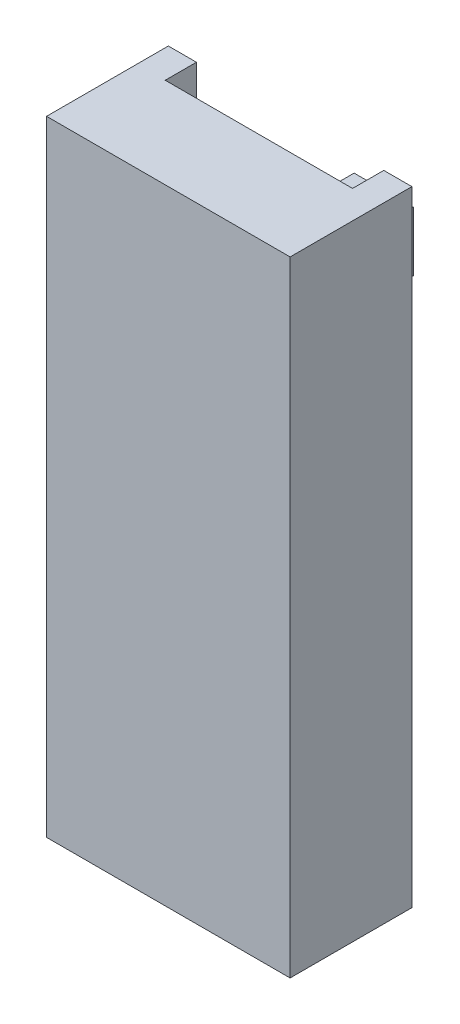
ISO-10303-21;
HEADER;
FILE_DESCRIPTION(('STEP AP214'),'2;1');
FILE_NAME('part.step','',(''),(''),'','','');
FILE_SCHEMA(('AUTOMOTIVE_DESIGN { 1 0 10303 214 1 1 1 1 }'));
ENDSEC;
DATA;
#1=APPLICATION_CONTEXT('core data for automotive mechanical design processes');
#2=APPLICATION_PROTOCOL_DEFINITION('international standard','automotive_design',2000,#1);
#3=PRODUCT_CONTEXT('',#1,'mechanical');
#4=PRODUCT('Part','Part','',(#3));
#5=PRODUCT_RELATED_PRODUCT_CATEGORY('part','',(#4));
#6=PRODUCT_DEFINITION_FORMATION('','',#4);
#7=PRODUCT_DEFINITION_CONTEXT('part definition',#1,'design');
#8=PRODUCT_DEFINITION('design','',#6,#7);
#9=PRODUCT_DEFINITION_SHAPE('','',#8);
#10=(LENGTH_UNIT() NAMED_UNIT(*) SI_UNIT(.MILLI.,.METRE.));
#11=(NAMED_UNIT(*) PLANE_ANGLE_UNIT() SI_UNIT($,.RADIAN.));
#12=(NAMED_UNIT(*) SI_UNIT($,.STERADIAN.) SOLID_ANGLE_UNIT());
#13=UNCERTAINTY_MEASURE_WITH_UNIT(LENGTH_MEASURE(1.E-05),#10,'distance_accuracy_value','');
#14=(GEOMETRIC_REPRESENTATION_CONTEXT(3) GLOBAL_UNCERTAINTY_ASSIGNED_CONTEXT((#13)) GLOBAL_UNIT_ASSIGNED_CONTEXT((#10,
#11,#12)) REPRESENTATION_CONTEXT('',''));
#15=CARTESIAN_POINT('',(0.,0.,0.));
#16=DIRECTION('',(0.,0.,1.));
#17=DIRECTION('',(1.,0.,0.));
#18=AXIS2_PLACEMENT_3D('',#15,#16,#17);
#19=CARTESIAN_POINT('',(-2.63874073652364,20.,-2.19751319098254));
#20=DIRECTION('',(0.,0.,1.));
#21=DIRECTION('',(1.,0.,0.));
#22=AXIS2_PLACEMENT_3D('',#19,#20,#21);
#23=PLANE('',#22);
#24=DIRECTION('',(-1.,0.,0.));
#25=VECTOR('',#24,1.);
#26=CARTESIAN_POINT('',(1.26125926347636,15.5,-2.19751319098254));
#27=LINE('',#26,#25);
#28=CARTESIAN_POINT('',(1.26125926347636,15.5,-2.19751319098254));
#29=VERTEX_POINT('',#28);
#30=CARTESIAN_POINT('',(-0.738740736523644,15.5,-2.19751319098254));
#31=VERTEX_POINT('',#30);
#32=EDGE_CURVE('E211',#29,#31,#27,.T.);
#33=ORIENTED_EDGE('',*,*,#32,.F.);
#34=DIRECTION('',(0.,-1.,0.));
#35=VECTOR('',#34,1.);
#36=CARTESIAN_POINT('',(1.26125926347636,17.5,-2.19751319098254));
#37=LINE('',#36,#35);
#38=CARTESIAN_POINT('',(1.26125926347636,17.5,-2.19751319098254));
#39=VERTEX_POINT('',#38);
#40=EDGE_CURVE('E48',#39,#29,#37,.T.);
#41=ORIENTED_EDGE('',*,*,#40,.F.);
#42=DIRECTION('',(1.,0.,0.));
#43=VECTOR('',#42,1.);
#44=CARTESIAN_POINT('',(1.26125926347636,17.5,-2.19751319098254));
#45=LINE('',#44,#43);
#46=CARTESIAN_POINT('',(-0.738740736523643,17.5,-2.19751319098254));
#47=VERTEX_POINT('',#46);
#48=EDGE_CURVE('E202',#47,#39,#45,.T.);
#49=ORIENTED_EDGE('',*,*,#48,.F.);
#50=DIRECTION('',(0.,1.,0.));
#51=VECTOR('',#50,1.);
#52=CARTESIAN_POINT('',(-0.738740736523643,17.5,-2.19751319098254));
#53=LINE('',#52,#51);
#54=EDGE_CURVE('E205',#31,#47,#53,.T.);
#55=ORIENTED_EDGE('',*,*,#54,.F.);
#56=EDGE_LOOP('',(#33,#41,#49,#55));
#57=FACE_BOUND('',#56,.T.);
#58=DIRECTION('',(-1.,0.,0.));
#59=VECTOR('',#58,1.);
#60=CARTESIAN_POINT('',(4.26125926347636,18.,-2.19751319098254));
#61=LINE('',#60,#59);
#62=CARTESIAN_POINT('',(4.26125926347636,18.,-2.19751319098254));
#63=VERTEX_POINT('',#62);
#64=CARTESIAN_POINT('',(-1.73874073652364,18.,-2.19751319098254));
#65=VERTEX_POINT('',#64);
#66=EDGE_CURVE('E254',#63,#65,#61,.T.);
#67=ORIENTED_EDGE('',*,*,#66,.F.);
#68=DIRECTION('',(0.,1.,0.));
#69=VECTOR('',#68,1.);
#70=CARTESIAN_POINT('',(4.26125926347636,18.,-2.19751319098254));
#71=LINE('',#70,#69);
#72=CARTESIAN_POINT('',(4.26125926347636,20.,-2.19751319098254));
#73=VERTEX_POINT('',#72);
#74=EDGE_CURVE('E264',#63,#73,#71,.T.);
#75=ORIENTED_EDGE('',*,*,#74,.T.);
#76=DIRECTION('',(-1.,0.,0.));
#77=VECTOR('',#76,1.);
#78=CARTESIAN_POINT('',(-2.63874073652364,20.,-2.19751319098254));
#79=LINE('',#78,#77);
#80=CARTESIAN_POINT('',(5.16125926347636,20.,-2.19751319098254));
#81=VERTEX_POINT('',#80);
#82=EDGE_CURVE('E333',#81,#73,#79,.T.);
#83=ORIENTED_EDGE('',*,*,#82,.F.);
#84=DIRECTION('',(0.,-1.,0.));
#85=VECTOR('',#84,1.);
#86=CARTESIAN_POINT('',(5.16125926347636,20.,-2.19751319098254));
#87=LINE('',#86,#85);
#88=CARTESIAN_POINT('',(5.16125926347636,0.,-2.19751319098254));
#89=VERTEX_POINT('',#88);
#90=EDGE_CURVE('E348',#81,#89,#87,.T.);
#91=ORIENTED_EDGE('',*,*,#90,.T.);
#92=DIRECTION('',(-1.,0.,0.));
#93=VECTOR('',#92,1.);
#94=CARTESIAN_POINT('',(-2.63874073652364,0.,-2.19751319098254));
#95=LINE('',#94,#93);
#96=CARTESIAN_POINT('',(4.26125926347636,0.,-2.19751319098254));
#97=VERTEX_POINT('',#96);
#98=EDGE_CURVE('E328',#89,#97,#95,.T.);
#99=ORIENTED_EDGE('',*,*,#98,.T.);
#100=DIRECTION('',(0.,-1.,0.));
#101=VECTOR('',#100,1.);
#102=CARTESIAN_POINT('',(4.26125926347636,15.,-2.19751319098254));
#103=LINE('',#102,#101);
#104=CARTESIAN_POINT('',(4.26125926347636,15.,-2.19751319098254));
#105=VERTEX_POINT('',#104);
#106=EDGE_CURVE('E315',#105,#97,#103,.T.);
#107=ORIENTED_EDGE('',*,*,#106,.F.);
#108=DIRECTION('',(1.,0.,0.));
#109=VECTOR('',#108,1.);
#110=CARTESIAN_POINT('',(0.,15.,-2.19751319098254));
#111=LINE('',#110,#109);
#112=CARTESIAN_POINT('',(-1.73874073652364,15.,-2.19751319098254));
#113=VERTEX_POINT('',#112);
#114=EDGE_CURVE('E288',#113,#105,#111,.T.);
#115=ORIENTED_EDGE('',*,*,#114,.F.);
#116=DIRECTION('',(0.,-1.,0.));
#117=VECTOR('',#116,1.);
#118=CARTESIAN_POINT('',(-1.73874073652364,15.,-2.19751319098254));
#119=LINE('',#118,#117);
#120=CARTESIAN_POINT('',(-1.73874073652364,0.,-2.19751319098254));
#121=VERTEX_POINT('',#120);
#122=EDGE_CURVE('E317',#113,#121,#119,.T.);
#123=ORIENTED_EDGE('',*,*,#122,.T.);
#124=CARTESIAN_POINT('',(-2.63874073652364,0.,-2.19751319098254));
#125=VERTEX_POINT('',#124);
#126=EDGE_CURVE('E343',#121,#125,#95,.T.);
#127=ORIENTED_EDGE('',*,*,#126,.T.);
#128=DIRECTION('',(0.,-1.,0.));
#129=VECTOR('',#128,1.);
#130=CARTESIAN_POINT('',(-2.63874073652364,20.,-2.19751319098254));
#131=LINE('',#130,#129);
#132=CARTESIAN_POINT('',(-2.63874073652364,20.,-2.19751319098254));
#133=VERTEX_POINT('',#132);
#134=EDGE_CURVE('E336',#133,#125,#131,.T.);
#135=ORIENTED_EDGE('',*,*,#134,.F.);
#136=CARTESIAN_POINT('',(-1.73874073652364,20.,-2.19751319098254));
#137=VERTEX_POINT('',#136);
#138=EDGE_CURVE('E332',#137,#133,#79,.T.);
#139=ORIENTED_EDGE('',*,*,#138,.F.);
#140=DIRECTION('',(0.,1.,0.));
#141=VECTOR('',#140,1.);
#142=CARTESIAN_POINT('',(-1.73874073652364,18.,-2.19751319098254));
#143=LINE('',#142,#141);
#144=EDGE_CURVE('E276',#65,#137,#143,.T.);
#145=ORIENTED_EDGE('',*,*,#144,.F.);
#146=EDGE_LOOP('',(#67,#75,#83,#91,#99,#107,#115,#123,#127,#135,#139,#145));
#147=FACE_BOUND('',#146,.T.);
#148=DIRECTION('',(0.,-1.,0.));
#149=VECTOR('',#148,1.);
#150=CARTESIAN_POINT('',(3.21125926347636,17.45,-2.19751319098254));
#151=LINE('',#150,#149);
#152=CARTESIAN_POINT('',(3.21125926347636,17.45,-2.19751319098254));
#153=VERTEX_POINT('',#152);
#154=CARTESIAN_POINT('',(3.21125926347636,15.55,-2.19751319098254));
#155=VERTEX_POINT('',#154);
#156=EDGE_CURVE('E217',#153,#155,#151,.T.);
#157=ORIENTED_EDGE('',*,*,#156,.F.);
#158=DIRECTION('',(1.,0.,0.));
#159=VECTOR('',#158,1.);
#160=CARTESIAN_POINT('',(3.21125926347636,17.45,-2.19751319098254));
#161=LINE('',#160,#159);
#162=CARTESIAN_POINT('',(1.31125926347636,17.45,-2.19751319098254));
#163=VERTEX_POINT('',#162);
#164=EDGE_CURVE('E225',#163,#153,#161,.T.);
#165=ORIENTED_EDGE('',*,*,#164,.F.);
#166=DIRECTION('',(0.,1.,0.));
#167=VECTOR('',#166,1.);
#168=CARTESIAN_POINT('',(1.31125926347636,17.45,-2.19751319098254));
#169=LINE('',#168,#167);
#170=CARTESIAN_POINT('',(1.31125926347636,15.55,-2.19751319098254));
#171=VERTEX_POINT('',#170);
#172=EDGE_CURVE('E235',#171,#163,#169,.T.);
#173=ORIENTED_EDGE('',*,*,#172,.F.);
#174=DIRECTION('',(-1.,0.,0.));
#175=VECTOR('',#174,1.);
#176=CARTESIAN_POINT('',(3.21125926347636,15.55,-2.19751319098254));
#177=LINE('',#176,#175);
#178=EDGE_CURVE('E56',#155,#171,#177,.T.);
#179=ORIENTED_EDGE('',*,*,#178,.F.);
#180=EDGE_LOOP('',(#157,#165,#173,#179));
#181=FACE_BOUND('',#180,.T.);
#182=ADVANCED_FACE('F33',(#57,#147,#181),#23,.F.);
#183=CARTESIAN_POINT('',(0.,0.,0.));
#184=DIRECTION('',(0.,1.,0.));
#185=DIRECTION('',(0.,0.,1.));
#186=AXIS2_PLACEMENT_3D('',#183,#184,#185);
#187=PLANE('',#186);
#188=DIRECTION('',(0.,0.,-1.));
#189=VECTOR('',#188,1.);
#190=CARTESIAN_POINT('',(4.26125926347635,0.,0.));
#191=LINE('',#190,#189);
#192=CARTESIAN_POINT('',(4.26125926347636,0.,-1.44751319098254));
#193=VERTEX_POINT('',#192);
#194=EDGE_CURVE('E304',#193,#97,#191,.T.);
#195=ORIENTED_EDGE('',*,*,#194,.T.);
#196=ORIENTED_EDGE('',*,*,#98,.F.);
#197=DIRECTION('',(0.,0.,-1.));
#198=VECTOR('',#197,1.);
#199=CARTESIAN_POINT('',(5.16125926347636,0.,-2.19751319098254));
#200=LINE('',#199,#198);
#201=CARTESIAN_POINT('',(5.16125926347636,0.,1.70248680901746));
#202=VERTEX_POINT('',#201);
#203=EDGE_CURVE('E341',#202,#89,#200,.T.);
#204=ORIENTED_EDGE('',*,*,#203,.F.);
#205=DIRECTION('',(1.,0.,0.));
#206=VECTOR('',#205,1.);
#207=CARTESIAN_POINT('',(-2.63874073652364,0.,1.70248680901746));
#208=LINE('',#207,#206);
#209=CARTESIAN_POINT('',(-2.63874073652364,0.,1.70248680901746));
#210=VERTEX_POINT('',#209);
#211=EDGE_CURVE('E339',#210,#202,#208,.T.);
#212=ORIENTED_EDGE('',*,*,#211,.F.);
#213=DIRECTION('',(0.,0.,1.));
#214=VECTOR('',#213,1.);
#215=CARTESIAN_POINT('',(-2.63874073652364,0.,-2.19751319098254));
#216=LINE('',#215,#214);
#217=EDGE_CURVE('E312',#125,#210,#216,.T.);
#218=ORIENTED_EDGE('',*,*,#217,.F.);
#219=ORIENTED_EDGE('',*,*,#126,.F.);
#220=DIRECTION('',(0.,0.,1.));
#221=VECTOR('',#220,1.);
#222=CARTESIAN_POINT('',(-1.73874073652364,0.,0.));
#223=LINE('',#222,#221);
#224=CARTESIAN_POINT('',(-1.73874073652364,0.,-1.44751319098254));
#225=VERTEX_POINT('',#224);
#226=EDGE_CURVE('E301',#121,#225,#223,.T.);
#227=ORIENTED_EDGE('',*,*,#226,.T.);
#228=DIRECTION('',(1.,0.,0.));
#229=VECTOR('',#228,1.);
#230=CARTESIAN_POINT('',(0.,0.,-1.44751319098254));
#231=LINE('',#230,#229);
#232=CARTESIAN_POINT('',(-0.0377788422003011,0.,-1.44751319098254));
#233=VERTEX_POINT('',#232);
#234=EDGE_CURVE('E298',#225,#233,#231,.T.);
#235=ORIENTED_EDGE('',*,*,#234,.T.);
#236=CARTESIAN_POINT('',(1.26125926347636,0.,-2.19751319098254));
#237=DIRECTION('',(0.,-1.,0.));
#238=DIRECTION('',(0.,0.,-1.));
#239=AXIS2_PLACEMENT_3D('',#236,#237,#238);
#240=CIRCLE('',#239,1.5);
#241=CARTESIAN_POINT('',(2.56029736915302,0.,-1.44751319098254));
#242=VERTEX_POINT('',#241);
#243=EDGE_CURVE('E273',#233,#242,#240,.F.);
#244=ORIENTED_EDGE('',*,*,#243,.T.);
#245=DIRECTION('',(1.,0.,0.));
#246=VECTOR('',#245,1.);
#247=CARTESIAN_POINT('',(0.,0.,-1.44751319098254));
#248=LINE('',#247,#246);
#249=EDGE_CURVE('E284',#242,#193,#248,.T.);
#250=ORIENTED_EDGE('',*,*,#249,.T.);
#251=EDGE_LOOP('',(#195,#196,#204,#212,#218,#219,#227,#235,#244,#250));
#252=FACE_BOUND('',#251,.T.);
#253=ADVANCED_FACE('F360',(#252),#187,.F.);
#254=CARTESIAN_POINT('',(-2.63874073652364,20.,-2.19751319098254));
#255=DIRECTION('',(1.,0.,0.));
#256=DIRECTION('',(0.,0.,-1.));
#257=AXIS2_PLACEMENT_3D('',#254,#255,#256);
#258=PLANE('',#257);
#259=ORIENTED_EDGE('',*,*,#217,.T.);
#260=DIRECTION('',(0.,-1.,0.));
#261=VECTOR('',#260,1.);
#262=CARTESIAN_POINT('',(-2.63874073652364,20.,1.70248680901746));
#263=LINE('',#262,#261);
#264=CARTESIAN_POINT('',(-2.63874073652364,20.,1.70248680901746));
#265=VERTEX_POINT('',#264);
#266=EDGE_CURVE('E11',#265,#210,#263,.T.);
#267=ORIENTED_EDGE('',*,*,#266,.F.);
#268=DIRECTION('',(0.,0.,1.));
#269=VECTOR('',#268,1.);
#270=CARTESIAN_POINT('',(-2.63874073652364,20.,-2.19751319098254));
#271=LINE('',#270,#269);
#272=EDGE_CURVE('E324',#133,#265,#271,.T.);
#273=ORIENTED_EDGE('',*,*,#272,.F.);
#274=ORIENTED_EDGE('',*,*,#134,.T.);
#275=EDGE_LOOP('',(#259,#267,#273,#274));
#276=FACE_BOUND('',#275,.T.);
#277=ADVANCED_FACE('F35',(#276),#258,.F.);
#278=CARTESIAN_POINT('',(-2.63874073652364,20.,1.70248680901746));
#279=DIRECTION('',(0.,0.,-1.));
#280=DIRECTION('',(-1.,0.,0.));
#281=AXIS2_PLACEMENT_3D('',#278,#279,#280);
#282=PLANE('',#281);
#283=ORIENTED_EDGE('',*,*,#211,.T.);
#284=DIRECTION('',(0.,-1.,0.));
#285=VECTOR('',#284,1.);
#286=CARTESIAN_POINT('',(5.16125926347636,20.,1.70248680901746));
#287=LINE('',#286,#285);
#288=CARTESIAN_POINT('',(5.16125926347636,20.,1.70248680901746));
#289=VERTEX_POINT('',#288);
#290=EDGE_CURVE('E41',#289,#202,#287,.T.);
#291=ORIENTED_EDGE('',*,*,#290,.F.);
#292=DIRECTION('',(1.,0.,0.));
#293=VECTOR('',#292,1.);
#294=CARTESIAN_POINT('',(-2.63874073652364,20.,1.70248680901746));
#295=LINE('',#294,#293);
#296=EDGE_CURVE('E327',#265,#289,#295,.T.);
#297=ORIENTED_EDGE('',*,*,#296,.F.);
#298=ORIENTED_EDGE('',*,*,#266,.T.);
#299=EDGE_LOOP('',(#283,#291,#297,#298));
#300=FACE_BOUND('',#299,.T.);
#301=ADVANCED_FACE('F374',(#300),#282,.F.);
#302=CARTESIAN_POINT('',(5.16125926347636,20.,-2.19751319098254));
#303=DIRECTION('',(-1.,0.,0.));
#304=DIRECTION('',(0.,0.,1.));
#305=AXIS2_PLACEMENT_3D('',#302,#303,#304);
#306=PLANE('',#305);
#307=ORIENTED_EDGE('',*,*,#203,.T.);
#308=ORIENTED_EDGE('',*,*,#90,.F.);
#309=DIRECTION('',(0.,0.,-1.));
#310=VECTOR('',#309,1.);
#311=CARTESIAN_POINT('',(5.16125926347636,20.,-2.19751319098254));
#312=LINE('',#311,#310);
#313=EDGE_CURVE('E330',#289,#81,#312,.T.);
#314=ORIENTED_EDGE('',*,*,#313,.F.);
#315=ORIENTED_EDGE('',*,*,#290,.T.);
#316=EDGE_LOOP('',(#307,#308,#314,#315));
#317=FACE_BOUND('',#316,.T.);
#318=ADVANCED_FACE('F355',(#317),#306,.F.);
#319=CARTESIAN_POINT('',(0.,20.,0.));
#320=DIRECTION('',(0.,1.,0.));
#321=DIRECTION('',(0.,0.,1.));
#322=AXIS2_PLACEMENT_3D('',#319,#320,#321);
#323=PLANE('',#322);
#324=DIRECTION('',(0.,0.,-1.));
#325=VECTOR('',#324,1.);
#326=CARTESIAN_POINT('',(4.26125926347636,20.,-2.19751319098254));
#327=LINE('',#326,#325);
#328=CARTESIAN_POINT('',(4.26125926347636,20.,-1.19751319098254));
#329=VERTEX_POINT('',#328);
#330=EDGE_CURVE('E250',#329,#73,#327,.T.);
#331=ORIENTED_EDGE('',*,*,#330,.F.);
#332=DIRECTION('',(1.,0.,0.));
#333=VECTOR('',#332,1.);
#334=CARTESIAN_POINT('',(4.26125926347636,20.,-1.19751319098254));
#335=LINE('',#334,#333);
#336=CARTESIAN_POINT('',(-1.73874073652364,20.,-1.19751319098254));
#337=VERTEX_POINT('',#336);
#338=EDGE_CURVE('E255',#337,#329,#335,.T.);
#339=ORIENTED_EDGE('',*,*,#338,.F.);
#340=DIRECTION('',(0.,0.,1.));
#341=VECTOR('',#340,1.);
#342=CARTESIAN_POINT('',(-1.73874073652364,20.,-2.19751319098254));
#343=LINE('',#342,#341);
#344=EDGE_CURVE('E266',#137,#337,#343,.T.);
#345=ORIENTED_EDGE('',*,*,#344,.F.);
#346=ORIENTED_EDGE('',*,*,#138,.T.);
#347=ORIENTED_EDGE('',*,*,#272,.T.);
#348=ORIENTED_EDGE('',*,*,#296,.T.);
#349=ORIENTED_EDGE('',*,*,#313,.T.);
#350=ORIENTED_EDGE('',*,*,#82,.T.);
#351=EDGE_LOOP('',(#331,#339,#345,#346,#347,#348,#349,#350));
#352=FACE_BOUND('',#351,.T.);
#353=ADVANCED_FACE('F370',(#352),#323,.T.);
#354=CARTESIAN_POINT('',(1.26125926347636,15.,-2.19751319098254));
#355=DIRECTION('',(0.,-1.,0.));
#356=DIRECTION('',(0.,0.,-1.));
#357=AXIS2_PLACEMENT_3D('',#354,#355,#356);
#358=CYLINDRICAL_SURFACE('',#357,1.5);
#359=ORIENTED_EDGE('',*,*,#243,.F.);
#360=DIRECTION('',(0.,-1.,0.));
#361=VECTOR('',#360,1.);
#362=CARTESIAN_POINT('',(-0.0377788422003011,15.,-1.44751319098254));
#363=LINE('',#362,#361);
#364=CARTESIAN_POINT('',(-0.0377788422003011,15.,-1.44751319098254));
#365=VERTEX_POINT('',#364);
#366=EDGE_CURVE('E295',#365,#233,#363,.T.);
#367=ORIENTED_EDGE('',*,*,#366,.F.);
#368=CARTESIAN_POINT('',(1.26125926347636,15.,-2.19751319098254));
#369=DIRECTION('',(0.,-1.,0.));
#370=DIRECTION('',(0.,0.,-1.));
#371=AXIS2_PLACEMENT_3D('',#368,#369,#370);
#372=CIRCLE('',#371,1.5);
#373=CARTESIAN_POINT('',(2.56029736915302,15.,-1.44751319098254));
#374=VERTEX_POINT('',#373);
#375=EDGE_CURVE('E280',#365,#374,#372,.F.);
#376=ORIENTED_EDGE('',*,*,#375,.T.);
#377=DIRECTION('',(0.,-1.,0.));
#378=VECTOR('',#377,1.);
#379=CARTESIAN_POINT('',(2.56029736915302,15.,-1.44751319098254));
#380=LINE('',#379,#378);
#381=EDGE_CURVE('E309',#374,#242,#380,.T.);
#382=ORIENTED_EDGE('',*,*,#381,.T.);
#383=EDGE_LOOP('',(#359,#367,#376,#382));
#384=FACE_BOUND('',#383,.T.);
#385=ADVANCED_FACE('F393',(#384),#358,.F.);
#386=CARTESIAN_POINT('',(0.,15.,-1.44751319098254));
#387=DIRECTION('',(0.,0.,-1.));
#388=DIRECTION('',(-1.,0.,0.));
#389=AXIS2_PLACEMENT_3D('',#386,#387,#388);
#390=PLANE('',#389);
#391=ORIENTED_EDGE('',*,*,#249,.F.);
#392=ORIENTED_EDGE('',*,*,#381,.F.);
#393=DIRECTION('',(1.,0.,0.));
#394=VECTOR('',#393,1.);
#395=CARTESIAN_POINT('',(0.,15.,-1.44751319098254));
#396=LINE('',#395,#394);
#397=CARTESIAN_POINT('',(4.26125926347636,15.,-1.44751319098254));
#398=VERTEX_POINT('',#397);
#399=EDGE_CURVE('E293',#374,#398,#396,.T.);
#400=ORIENTED_EDGE('',*,*,#399,.T.);
#401=DIRECTION('',(0.,-1.,0.));
#402=VECTOR('',#401,1.);
#403=CARTESIAN_POINT('',(4.26125926347636,15.,-1.44751319098254));
#404=LINE('',#403,#402);
#405=EDGE_CURVE('E313',#398,#193,#404,.T.);
#406=ORIENTED_EDGE('',*,*,#405,.T.);
#407=EDGE_LOOP('',(#391,#392,#400,#406));
#408=FACE_BOUND('',#407,.T.);
#409=ADVANCED_FACE('F396',(#408),#390,.T.);
#410=CARTESIAN_POINT('',(4.26125926347635,15.,0.));
#411=DIRECTION('',(-1.,0.,0.));
#412=DIRECTION('',(0.,0.,1.));
#413=AXIS2_PLACEMENT_3D('',#410,#411,#412);
#414=PLANE('',#413);
#415=ORIENTED_EDGE('',*,*,#194,.F.);
#416=ORIENTED_EDGE('',*,*,#405,.F.);
#417=DIRECTION('',(0.,0.,-1.));
#418=VECTOR('',#417,1.);
#419=CARTESIAN_POINT('',(4.26125926347635,15.,0.));
#420=LINE('',#419,#418);
#421=EDGE_CURVE('E291',#398,#105,#420,.T.);
#422=ORIENTED_EDGE('',*,*,#421,.T.);
#423=ORIENTED_EDGE('',*,*,#106,.T.);
#424=EDGE_LOOP('',(#415,#416,#422,#423));
#425=FACE_BOUND('',#424,.T.);
#426=ADVANCED_FACE('F399',(#425),#414,.T.);
#427=CARTESIAN_POINT('',(-1.73874073652364,15.,0.));
#428=DIRECTION('',(1.,0.,0.));
#429=DIRECTION('',(0.,0.,-1.));
#430=AXIS2_PLACEMENT_3D('',#427,#428,#429);
#431=PLANE('',#430);
#432=ORIENTED_EDGE('',*,*,#226,.F.);
#433=ORIENTED_EDGE('',*,*,#122,.F.);
#434=DIRECTION('',(0.,0.,1.));
#435=VECTOR('',#434,1.);
#436=CARTESIAN_POINT('',(-1.73874073652364,15.,0.));
#437=LINE('',#436,#435);
#438=CARTESIAN_POINT('',(-1.73874073652364,15.,-1.44751319098254));
#439=VERTEX_POINT('',#438);
#440=EDGE_CURVE('E286',#113,#439,#437,.T.);
#441=ORIENTED_EDGE('',*,*,#440,.T.);
#442=DIRECTION('',(0.,-1.,0.));
#443=VECTOR('',#442,1.);
#444=CARTESIAN_POINT('',(-1.73874073652364,15.,-1.44751319098254));
#445=LINE('',#444,#443);
#446=EDGE_CURVE('E320',#439,#225,#445,.T.);
#447=ORIENTED_EDGE('',*,*,#446,.T.);
#448=EDGE_LOOP('',(#432,#433,#441,#447));
#449=FACE_BOUND('',#448,.T.);
#450=ADVANCED_FACE('F381',(#449),#431,.T.);
#451=CARTESIAN_POINT('',(0.,15.,-1.44751319098254));
#452=DIRECTION('',(0.,0.,-1.));
#453=DIRECTION('',(-1.,0.,0.));
#454=AXIS2_PLACEMENT_3D('',#451,#452,#453);
#455=PLANE('',#454);
#456=ORIENTED_EDGE('',*,*,#234,.F.);
#457=ORIENTED_EDGE('',*,*,#446,.F.);
#458=DIRECTION('',(1.,0.,0.));
#459=VECTOR('',#458,1.);
#460=CARTESIAN_POINT('',(0.,15.,-1.44751319098254));
#461=LINE('',#460,#459);
#462=EDGE_CURVE('E283',#439,#365,#461,.T.);
#463=ORIENTED_EDGE('',*,*,#462,.T.);
#464=ORIENTED_EDGE('',*,*,#366,.T.);
#465=EDGE_LOOP('',(#456,#457,#463,#464));
#466=FACE_BOUND('',#465,.T.);
#467=ADVANCED_FACE('F391',(#466),#455,.T.);
#468=CARTESIAN_POINT('',(0.,15.,0.));
#469=DIRECTION('',(0.,-1.,0.));
#470=DIRECTION('',(0.,0.,-1.));
#471=AXIS2_PLACEMENT_3D('',#468,#469,#470);
#472=PLANE('',#471);
#473=ORIENTED_EDGE('',*,*,#375,.F.);
#474=ORIENTED_EDGE('',*,*,#462,.F.);
#475=ORIENTED_EDGE('',*,*,#440,.F.);
#476=ORIENTED_EDGE('',*,*,#114,.T.);
#477=ORIENTED_EDGE('',*,*,#421,.F.);
#478=ORIENTED_EDGE('',*,*,#399,.F.);
#479=EDGE_LOOP('',(#473,#474,#475,#476,#477,#478));
#480=FACE_BOUND('',#479,.T.);
#481=ADVANCED_FACE('F386',(#480),#472,.T.);
#482=CARTESIAN_POINT('',(4.26125926347636,18.,-2.19751319098254));
#483=DIRECTION('',(1.,0.,0.));
#484=DIRECTION('',(0.,0.,-1.));
#485=AXIS2_PLACEMENT_3D('',#482,#483,#484);
#486=PLANE('',#485);
#487=ORIENTED_EDGE('',*,*,#330,.T.);
#488=ORIENTED_EDGE('',*,*,#74,.F.);
#489=DIRECTION('',(0.,0.,-1.));
#490=VECTOR('',#489,1.);
#491=CARTESIAN_POINT('',(4.26125926347636,18.,-2.19751319098254));
#492=LINE('',#491,#490);
#493=CARTESIAN_POINT('',(4.26125926347636,18.,-1.19751319098254));
#494=VERTEX_POINT('',#493);
#495=EDGE_CURVE('E251',#494,#63,#492,.T.);
#496=ORIENTED_EDGE('',*,*,#495,.F.);
#497=DIRECTION('',(0.,1.,0.));
#498=VECTOR('',#497,1.);
#499=CARTESIAN_POINT('',(4.26125926347636,18.,-1.19751319098254));
#500=LINE('',#499,#498);
#501=EDGE_CURVE('E271',#494,#329,#500,.T.);
#502=ORIENTED_EDGE('',*,*,#501,.T.);
#503=EDGE_LOOP('',(#487,#488,#496,#502));
#504=FACE_BOUND('',#503,.T.);
#505=ADVANCED_FACE('F475',(#504),#486,.F.);
#506=CARTESIAN_POINT('',(4.26125926347636,18.,-1.19751319098254));
#507=DIRECTION('',(0.,0.,1.));
#508=DIRECTION('',(1.,0.,0.));
#509=AXIS2_PLACEMENT_3D('',#506,#507,#508);
#510=PLANE('',#509);
#511=ORIENTED_EDGE('',*,*,#338,.T.);
#512=ORIENTED_EDGE('',*,*,#501,.F.);
#513=DIRECTION('',(1.,0.,0.));
#514=VECTOR('',#513,1.);
#515=CARTESIAN_POINT('',(4.26125926347636,18.,-1.19751319098254));
#516=LINE('',#515,#514);
#517=CARTESIAN_POINT('',(-1.73874073652364,18.,-1.19751319098254));
#518=VERTEX_POINT('',#517);
#519=EDGE_CURVE('E261',#518,#494,#516,.T.);
#520=ORIENTED_EDGE('',*,*,#519,.F.);
#521=DIRECTION('',(0.,1.,0.));
#522=VECTOR('',#521,1.);
#523=CARTESIAN_POINT('',(-1.73874073652364,18.,-1.19751319098254));
#524=LINE('',#523,#522);
#525=EDGE_CURVE('E274',#518,#337,#524,.T.);
#526=ORIENTED_EDGE('',*,*,#525,.T.);
#527=EDGE_LOOP('',(#511,#512,#520,#526));
#528=FACE_BOUND('',#527,.T.);
#529=ADVANCED_FACE('F490',(#528),#510,.F.);
#530=CARTESIAN_POINT('',(-1.73874073652364,18.,-2.19751319098254));
#531=DIRECTION('',(-1.,0.,0.));
#532=DIRECTION('',(0.,0.,1.));
#533=AXIS2_PLACEMENT_3D('',#530,#531,#532);
#534=PLANE('',#533);
#535=ORIENTED_EDGE('',*,*,#344,.T.);
#536=ORIENTED_EDGE('',*,*,#525,.F.);
#537=DIRECTION('',(0.,0.,1.));
#538=VECTOR('',#537,1.);
#539=CARTESIAN_POINT('',(-1.73874073652364,18.,-2.19751319098254));
#540=LINE('',#539,#538);
#541=EDGE_CURVE('E258',#65,#518,#540,.T.);
#542=ORIENTED_EDGE('',*,*,#541,.F.);
#543=ORIENTED_EDGE('',*,*,#144,.T.);
#544=EDGE_LOOP('',(#535,#536,#542,#543));
#545=FACE_BOUND('',#544,.T.);
#546=ADVANCED_FACE('F500',(#545),#534,.F.);
#547=CARTESIAN_POINT('',(0.,18.,0.));
#548=DIRECTION('',(0.,-1.,0.));
#549=DIRECTION('',(0.,0.,-1.));
#550=AXIS2_PLACEMENT_3D('',#547,#548,#549);
#551=PLANE('',#550);
#552=ORIENTED_EDGE('',*,*,#495,.T.);
#553=ORIENTED_EDGE('',*,*,#66,.T.);
#554=ORIENTED_EDGE('',*,*,#541,.T.);
#555=ORIENTED_EDGE('',*,*,#519,.T.);
#556=EDGE_LOOP('',(#552,#553,#554,#555));
#557=FACE_BOUND('',#556,.T.);
#558=ADVANCED_FACE('F510',(#557),#551,.F.);
#559=CARTESIAN_POINT('',(3.21125926347636,17.45,-4.19751319098254));
#560=DIRECTION('',(-1.,0.,0.));
#561=DIRECTION('',(0.,-1.,0.));
#562=AXIS2_PLACEMENT_3D('',#559,#560,#561);
#563=PLANE('',#562);
#564=ORIENTED_EDGE('',*,*,#156,.T.);
#565=DIRECTION('',(0.,0.,1.));
#566=VECTOR('',#565,1.);
#567=CARTESIAN_POINT('',(3.21125926347636,15.55,-4.19751319098254));
#568=LINE('',#567,#566);
#569=CARTESIAN_POINT('',(3.21125926347636,15.55,-4.19751319098254));
#570=VERTEX_POINT('',#569);
#571=EDGE_CURVE('E248',#570,#155,#568,.T.);
#572=ORIENTED_EDGE('',*,*,#571,.F.);
#573=DIRECTION('',(0.,-1.,0.));
#574=VECTOR('',#573,1.);
#575=CARTESIAN_POINT('',(3.21125926347636,17.45,-4.19751319098254));
#576=LINE('',#575,#574);
#577=CARTESIAN_POINT('',(3.21125926347636,17.45,-4.19751319098254));
#578=VERTEX_POINT('',#577);
#579=EDGE_CURVE('E221',#578,#570,#576,.T.);
#580=ORIENTED_EDGE('',*,*,#579,.F.);
#581=DIRECTION('',(0.,0.,1.));
#582=VECTOR('',#581,1.);
#583=CARTESIAN_POINT('',(3.21125926347636,17.45,-4.19751319098254));
#584=LINE('',#583,#582);
#585=EDGE_CURVE('E231',#578,#153,#584,.T.);
#586=ORIENTED_EDGE('',*,*,#585,.T.);
#587=EDGE_LOOP('',(#564,#572,#580,#586));
#588=FACE_BOUND('',#587,.T.);
#589=ADVANCED_FACE('F520',(#588),#563,.F.);
#590=CARTESIAN_POINT('',(3.21125926347636,15.55,-4.19751319098254));
#591=DIRECTION('',(0.,1.,0.));
#592=DIRECTION('',(0.,0.,1.));
#593=AXIS2_PLACEMENT_3D('',#590,#591,#592);
#594=PLANE('',#593);
#595=ORIENTED_EDGE('',*,*,#178,.T.);
#596=DIRECTION('',(0.,0.,1.));
#597=VECTOR('',#596,1.);
#598=CARTESIAN_POINT('',(1.31125926347636,15.55,-4.19751319098254));
#599=LINE('',#598,#597);
#600=CARTESIAN_POINT('',(1.31125926347636,15.55,-4.19751319098254));
#601=VERTEX_POINT('',#600);
#602=EDGE_CURVE('E245',#601,#171,#599,.T.);
#603=ORIENTED_EDGE('',*,*,#602,.F.);
#604=DIRECTION('',(-1.,0.,0.));
#605=VECTOR('',#604,1.);
#606=CARTESIAN_POINT('',(3.21125926347636,15.55,-4.19751319098254));
#607=LINE('',#606,#605);
#608=EDGE_CURVE('E224',#570,#601,#607,.T.);
#609=ORIENTED_EDGE('',*,*,#608,.F.);
#610=ORIENTED_EDGE('',*,*,#571,.T.);
#611=EDGE_LOOP('',(#595,#603,#609,#610));
#612=FACE_BOUND('',#611,.T.);
#613=ADVANCED_FACE('F531',(#612),#594,.F.);
#614=CARTESIAN_POINT('',(1.31125926347636,17.45,-4.19751319098254));
#615=DIRECTION('',(1.,0.,0.));
#616=DIRECTION('',(0.,1.,0.));
#617=AXIS2_PLACEMENT_3D('',#614,#615,#616);
#618=PLANE('',#617);
#619=ORIENTED_EDGE('',*,*,#172,.T.);
#620=DIRECTION('',(0.,0.,1.));
#621=VECTOR('',#620,1.);
#622=CARTESIAN_POINT('',(1.31125926347636,17.45,-4.19751319098254));
#623=LINE('',#622,#621);
#624=CARTESIAN_POINT('',(1.31125926347636,17.45,-4.19751319098254));
#625=VERTEX_POINT('',#624);
#626=EDGE_CURVE('E242',#625,#163,#623,.T.);
#627=ORIENTED_EDGE('',*,*,#626,.F.);
#628=DIRECTION('',(0.,1.,0.));
#629=VECTOR('',#628,1.);
#630=CARTESIAN_POINT('',(1.31125926347636,17.45,-4.19751319098254));
#631=LINE('',#630,#629);
#632=EDGE_CURVE('E227',#601,#625,#631,.T.);
#633=ORIENTED_EDGE('',*,*,#632,.F.);
#634=ORIENTED_EDGE('',*,*,#602,.T.);
#635=EDGE_LOOP('',(#619,#627,#633,#634));
#636=FACE_BOUND('',#635,.T.);
#637=ADVANCED_FACE('F541',(#636),#618,.F.);
#638=CARTESIAN_POINT('',(3.21125926347636,17.45,-4.19751319098254));
#639=DIRECTION('',(0.,-1.,0.));
#640=DIRECTION('',(0.,0.,-1.));
#641=AXIS2_PLACEMENT_3D('',#638,#639,#640);
#642=PLANE('',#641);
#643=ORIENTED_EDGE('',*,*,#164,.T.);
#644=ORIENTED_EDGE('',*,*,#585,.F.);
#645=DIRECTION('',(1.,0.,0.));
#646=VECTOR('',#645,1.);
#647=CARTESIAN_POINT('',(3.21125926347636,17.45,-4.19751319098254));
#648=LINE('',#647,#646);
#649=EDGE_CURVE('E229',#625,#578,#648,.T.);
#650=ORIENTED_EDGE('',*,*,#649,.F.);
#651=ORIENTED_EDGE('',*,*,#626,.T.);
#652=EDGE_LOOP('',(#643,#644,#650,#651));
#653=FACE_BOUND('',#652,.T.);
#654=ADVANCED_FACE('F551',(#653),#642,.F.);
#655=CARTESIAN_POINT('',(0.,0.,-4.19751319098254));
#656=DIRECTION('',(0.,0.,-1.));
#657=DIRECTION('',(-1.,0.,0.));
#658=AXIS2_PLACEMENT_3D('',#655,#656,#657);
#659=PLANE('',#658);
#660=ORIENTED_EDGE('',*,*,#579,.T.);
#661=ORIENTED_EDGE('',*,*,#608,.T.);
#662=ORIENTED_EDGE('',*,*,#632,.T.);
#663=ORIENTED_EDGE('',*,*,#649,.T.);
#664=EDGE_LOOP('',(#660,#661,#662,#663));
#665=FACE_BOUND('',#664,.T.);
#666=ADVANCED_FACE('F561',(#665),#659,.T.);
#667=CARTESIAN_POINT('',(1.26125926347636,17.5,-0.197513190982543));
#668=DIRECTION('',(1.,0.,0.));
#669=DIRECTION('',(0.,1.,0.));
#670=AXIS2_PLACEMENT_3D('',#667,#668,#669);
#671=PLANE('',#670);
#672=ORIENTED_EDGE('',*,*,#40,.T.);
#673=DIRECTION('',(0.,0.,-1.));
#674=VECTOR('',#673,1.);
#675=CARTESIAN_POINT('',(1.26125926347636,15.5,-0.197513190982543));
#676=LINE('',#675,#674);
#677=CARTESIAN_POINT('',(1.26125926347636,15.5,-0.197513190982543));
#678=VERTEX_POINT('',#677);
#679=EDGE_CURVE('E180',#678,#29,#676,.T.);
#680=ORIENTED_EDGE('',*,*,#679,.F.);
#681=DIRECTION('',(0.,-1.,0.));
#682=VECTOR('',#681,1.);
#683=CARTESIAN_POINT('',(1.26125926347636,17.5,-0.197513190982543));
#684=LINE('',#683,#682);
#685=CARTESIAN_POINT('',(1.26125926347636,17.5,-0.197513190982543));
#686=VERTEX_POINT('',#685);
#687=EDGE_CURVE('E184',#686,#678,#684,.T.);
#688=ORIENTED_EDGE('',*,*,#687,.F.);
#689=DIRECTION('',(0.,0.,-1.));
#690=VECTOR('',#689,1.);
#691=CARTESIAN_POINT('',(1.26125926347636,17.5,-0.197513190982543));
#692=LINE('',#691,#690);
#693=EDGE_CURVE('E215',#686,#39,#692,.T.);
#694=ORIENTED_EDGE('',*,*,#693,.T.);
#695=EDGE_LOOP('',(#672,#680,#688,#694));
#696=FACE_BOUND('',#695,.T.);
#697=ADVANCED_FACE('F182',(#696),#671,.F.);
#698=CARTESIAN_POINT('',(1.26125926347636,17.5,-0.197513190982543));
#699=DIRECTION('',(0.,1.,0.));
#700=DIRECTION('',(0.,0.,1.));
#701=AXIS2_PLACEMENT_3D('',#698,#699,#700);
#702=PLANE('',#701);
#703=ORIENTED_EDGE('',*,*,#48,.T.);
#704=ORIENTED_EDGE('',*,*,#693,.F.);
#705=DIRECTION('',(1.,0.,0.));
#706=VECTOR('',#705,1.);
#707=CARTESIAN_POINT('',(1.26125926347636,17.5,-0.197513190982543));
#708=LINE('',#707,#706);
#709=CARTESIAN_POINT('',(-0.738740736523643,17.5,-0.197513190982543));
#710=VERTEX_POINT('',#709);
#711=EDGE_CURVE('E190',#710,#686,#708,.T.);
#712=ORIENTED_EDGE('',*,*,#711,.F.);
#713=DIRECTION('',(0.,0.,-1.));
#714=VECTOR('',#713,1.);
#715=CARTESIAN_POINT('',(-0.738740736523643,17.5,-0.197513190982543));
#716=LINE('',#715,#714);
#717=EDGE_CURVE('E218',#710,#47,#716,.T.);
#718=ORIENTED_EDGE('',*,*,#717,.T.);
#719=EDGE_LOOP('',(#703,#704,#712,#718));
#720=FACE_BOUND('',#719,.T.);
#721=ADVANCED_FACE('F583',(#720),#702,.F.);
#722=CARTESIAN_POINT('',(-0.738740736523643,17.5,-0.197513190982543));
#723=DIRECTION('',(-1.,0.,0.));
#724=DIRECTION('',(0.,-1.,0.));
#725=AXIS2_PLACEMENT_3D('',#722,#723,#724);
#726=PLANE('',#725);
#727=ORIENTED_EDGE('',*,*,#54,.T.);
#728=ORIENTED_EDGE('',*,*,#717,.F.);
#729=DIRECTION('',(0.,1.,0.));
#730=VECTOR('',#729,1.);
#731=CARTESIAN_POINT('',(-0.738740736523643,17.5,-0.197513190982543));
#732=LINE('',#731,#730);
#733=CARTESIAN_POINT('',(-0.738740736523644,15.5,-0.197513190982543));
#734=VERTEX_POINT('',#733);
#735=EDGE_CURVE('E198',#734,#710,#732,.T.);
#736=ORIENTED_EDGE('',*,*,#735,.F.);
#737=DIRECTION('',(0.,0.,-1.));
#738=VECTOR('',#737,1.);
#739=CARTESIAN_POINT('',(-0.738740736523644,15.5,-0.197513190982543));
#740=LINE('',#739,#738);
#741=EDGE_CURVE('E189',#734,#31,#740,.T.);
#742=ORIENTED_EDGE('',*,*,#741,.T.);
#743=EDGE_LOOP('',(#727,#728,#736,#742));
#744=FACE_BOUND('',#743,.T.);
#745=ADVANCED_FACE('F592',(#744),#726,.F.);
#746=CARTESIAN_POINT('',(1.26125926347636,15.5,-0.197513190982543));
#747=DIRECTION('',(0.,-1.,0.));
#748=DIRECTION('',(0.,0.,-1.));
#749=AXIS2_PLACEMENT_3D('',#746,#747,#748);
#750=PLANE('',#749);
#751=ORIENTED_EDGE('',*,*,#32,.T.);
#752=ORIENTED_EDGE('',*,*,#741,.F.);
#753=DIRECTION('',(-1.,0.,0.));
#754=VECTOR('',#753,1.);
#755=CARTESIAN_POINT('',(1.26125926347636,15.5,-0.197513190982543));
#756=LINE('',#755,#754);
#757=EDGE_CURVE('E193',#678,#734,#756,.T.);
#758=ORIENTED_EDGE('',*,*,#757,.F.);
#759=ORIENTED_EDGE('',*,*,#679,.T.);
#760=EDGE_LOOP('',(#751,#752,#758,#759));
#761=FACE_BOUND('',#760,.T.);
#762=ADVANCED_FACE('F194',(#761),#750,.F.);
#763=CARTESIAN_POINT('',(0.,0.,-0.197513190982543));
#764=DIRECTION('',(0.,0.,-1.));
#765=DIRECTION('',(-1.,0.,0.));
#766=AXIS2_PLACEMENT_3D('',#763,#764,#765);
#767=PLANE('',#766);
#768=ORIENTED_EDGE('',*,*,#687,.T.);
#769=ORIENTED_EDGE('',*,*,#757,.T.);
#770=ORIENTED_EDGE('',*,*,#735,.T.);
#771=ORIENTED_EDGE('',*,*,#711,.T.);
#772=EDGE_LOOP('',(#768,#769,#770,#771));
#773=FACE_BOUND('',#772,.T.);
#774=ADVANCED_FACE('F200',(#773),#767,.T.);
#775=CLOSED_SHELL('',(#182,#253,#277,#301,#318,#353,#385,#409,#426,#450,#467,#481,#505,#529,
#546,#558,#589,#613,#637,#654,#666,#697,#721,#745,#762,#774));
#776=MANIFOLD_SOLID_BREP('B2',#775);
#777=ADVANCED_BREP_SHAPE_REPRESENTATION('',(#18,#776),#14);
#778=SHAPE_DEFINITION_REPRESENTATION(#9,#777);
ENDSEC;
END-ISO-10303-21;
